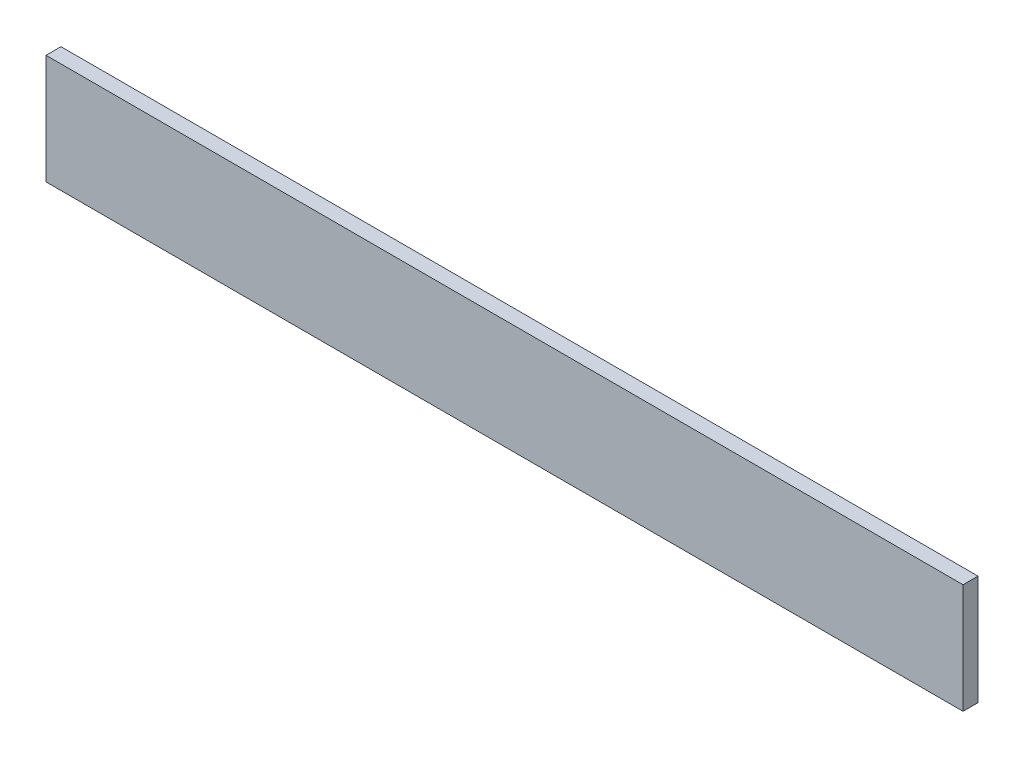
ISO-10303-21;
HEADER;
FILE_DESCRIPTION(('STEP AP214'),'2;1');
FILE_NAME('part.step','',(''),(''),'','','');
FILE_SCHEMA(('AUTOMOTIVE_DESIGN { 1 0 10303 214 1 1 1 1 }'));
ENDSEC;
DATA;
#1=APPLICATION_CONTEXT('core data for automotive mechanical design processes');
#2=APPLICATION_PROTOCOL_DEFINITION('international standard','automotive_design',2000,#1);
#3=PRODUCT_CONTEXT('',#1,'mechanical');
#4=PRODUCT('Part','Part','',(#3));
#5=PRODUCT_RELATED_PRODUCT_CATEGORY('part','',(#4));
#6=PRODUCT_DEFINITION_FORMATION('','',#4);
#7=PRODUCT_DEFINITION_CONTEXT('part definition',#1,'design');
#8=PRODUCT_DEFINITION('design','',#6,#7);
#9=PRODUCT_DEFINITION_SHAPE('','',#8);
#10=(LENGTH_UNIT() NAMED_UNIT(*) SI_UNIT(.MILLI.,.METRE.));
#11=(NAMED_UNIT(*) PLANE_ANGLE_UNIT() SI_UNIT($,.RADIAN.));
#12=(NAMED_UNIT(*) SI_UNIT($,.STERADIAN.) SOLID_ANGLE_UNIT());
#13=UNCERTAINTY_MEASURE_WITH_UNIT(LENGTH_MEASURE(1.E-05),#10,'distance_accuracy_value','');
#14=(GEOMETRIC_REPRESENTATION_CONTEXT(3) GLOBAL_UNCERTAINTY_ASSIGNED_CONTEXT((#13)) GLOBAL_UNIT_ASSIGNED_CONTEXT((#10,
#11,#12)) REPRESENTATION_CONTEXT('',''));
#15=CARTESIAN_POINT('',(0.,0.,0.));
#16=DIRECTION('',(0.,0.,1.));
#17=DIRECTION('',(1.,0.,0.));
#18=AXIS2_PLACEMENT_3D('',#15,#16,#17);
#19=CARTESIAN_POINT('',(0.,0.,19.05));
#20=DIRECTION('',(0.,0.,1.));
#21=DIRECTION('',(1.,0.,0.));
#22=AXIS2_PLACEMENT_3D('',#19,#20,#21);
#23=PLANE('',#22);
#24=DIRECTION('',(0.,1.,0.));
#25=VECTOR('',#24,1.);
#26=CARTESIAN_POINT('',(0.,139.7,19.05));
#27=LINE('',#26,#25);
#28=CARTESIAN_POINT('',(0.,0.,19.05));
#29=VERTEX_POINT('',#28);
#30=CARTESIAN_POINT('',(0.,139.7,19.05));
#31=VERTEX_POINT('',#30);
#32=EDGE_CURVE('E67',#29,#31,#27,.T.);
#33=ORIENTED_EDGE('',*,*,#32,.F.);
#34=DIRECTION('',(1.,0.,0.));
#35=VECTOR('',#34,1.);
#36=CARTESIAN_POINT('',(0.,0.,19.05));
#37=LINE('',#36,#35);
#38=CARTESIAN_POINT('',(1168.4,0.,19.05));
#39=VERTEX_POINT('',#38);
#40=EDGE_CURVE('E19',#39,#29,#37,.F.);
#41=ORIENTED_EDGE('',*,*,#40,.F.);
#42=DIRECTION('',(0.,1.,0.));
#43=VECTOR('',#42,1.);
#44=CARTESIAN_POINT('',(1168.4,0.,19.05));
#45=LINE('',#44,#43);
#46=CARTESIAN_POINT('',(1168.4,139.7,19.05));
#47=VERTEX_POINT('',#46);
#48=EDGE_CURVE('E57',#47,#39,#45,.F.);
#49=ORIENTED_EDGE('',*,*,#48,.F.);
#50=DIRECTION('',(1.,0.,0.));
#51=VECTOR('',#50,1.);
#52=CARTESIAN_POINT('',(1168.4,139.7,19.05));
#53=LINE('',#52,#51);
#54=EDGE_CURVE('E52',#31,#47,#53,.T.);
#55=ORIENTED_EDGE('',*,*,#54,.F.);
#56=EDGE_LOOP('',(#33,#41,#49,#55));
#57=FACE_BOUND('',#56,.T.);
#58=ADVANCED_FACE('F16',(#57),#23,.T.);
#59=CARTESIAN_POINT('',(0.,0.,0.));
#60=DIRECTION('',(0.,-1.,0.));
#61=DIRECTION('',(0.,0.,-1.));
#62=AXIS2_PLACEMENT_3D('',#59,#60,#61);
#63=PLANE('',#62);
#64=DIRECTION('',(0.,0.,1.));
#65=VECTOR('',#64,1.);
#66=CARTESIAN_POINT('',(0.,0.,0.));
#67=LINE('',#66,#65);
#68=CARTESIAN_POINT('',(0.,0.,0.));
#69=VERTEX_POINT('',#68);
#70=EDGE_CURVE('E78',#69,#29,#67,.T.);
#71=ORIENTED_EDGE('',*,*,#70,.F.);
#72=DIRECTION('',(1.,0.,0.));
#73=VECTOR('',#72,1.);
#74=CARTESIAN_POINT('',(0.,0.,0.));
#75=LINE('',#74,#73);
#76=CARTESIAN_POINT('',(1168.4,0.,0.));
#77=VERTEX_POINT('',#76);
#78=EDGE_CURVE('E73',#69,#77,#75,.T.);
#79=ORIENTED_EDGE('',*,*,#78,.T.);
#80=DIRECTION('',(0.,0.,-1.));
#81=VECTOR('',#80,1.);
#82=CARTESIAN_POINT('',(1168.4,0.,0.));
#83=LINE('',#82,#81);
#84=EDGE_CURVE('E62',#39,#77,#83,.T.);
#85=ORIENTED_EDGE('',*,*,#84,.F.);
#86=ORIENTED_EDGE('',*,*,#40,.T.);
#87=EDGE_LOOP('',(#71,#79,#85,#86));
#88=FACE_BOUND('',#87,.T.);
#89=ADVANCED_FACE('F72',(#88),#63,.T.);
#90=CARTESIAN_POINT('',(1168.4,0.,0.));
#91=DIRECTION('',(1.,0.,0.));
#92=DIRECTION('',(0.,0.,-1.));
#93=AXIS2_PLACEMENT_3D('',#90,#91,#92);
#94=PLANE('',#93);
#95=ORIENTED_EDGE('',*,*,#84,.T.);
#96=DIRECTION('',(0.,1.,0.));
#97=VECTOR('',#96,1.);
#98=CARTESIAN_POINT('',(1168.4,0.,0.));
#99=LINE('',#98,#97);
#100=CARTESIAN_POINT('',(1168.4,139.7,0.));
#101=VERTEX_POINT('',#100);
#102=EDGE_CURVE('E83',#77,#101,#99,.T.);
#103=ORIENTED_EDGE('',*,*,#102,.T.);
#104=DIRECTION('',(0.,0.,1.));
#105=VECTOR('',#104,1.);
#106=CARTESIAN_POINT('',(1168.4,139.7,0.));
#107=LINE('',#106,#105);
#108=EDGE_CURVE('E64',#47,#101,#107,.F.);
#109=ORIENTED_EDGE('',*,*,#108,.F.);
#110=ORIENTED_EDGE('',*,*,#48,.T.);
#111=EDGE_LOOP('',(#95,#103,#109,#110));
#112=FACE_BOUND('',#111,.T.);
#113=ADVANCED_FACE('F59',(#112),#94,.T.);
#114=CARTESIAN_POINT('',(1168.4,139.7,0.));
#115=DIRECTION('',(0.,1.,0.));
#116=DIRECTION('',(0.,0.,1.));
#117=AXIS2_PLACEMENT_3D('',#114,#115,#116);
#118=PLANE('',#117);
#119=ORIENTED_EDGE('',*,*,#108,.T.);
#120=DIRECTION('',(1.,0.,0.));
#121=VECTOR('',#120,1.);
#122=CARTESIAN_POINT('',(0.,139.7,0.));
#123=LINE('',#122,#121);
#124=CARTESIAN_POINT('',(0.,139.7,0.));
#125=VERTEX_POINT('',#124);
#126=EDGE_CURVE('E25',#101,#125,#123,.F.);
#127=ORIENTED_EDGE('',*,*,#126,.T.);
#128=DIRECTION('',(0.,0.,1.));
#129=VECTOR('',#128,1.);
#130=CARTESIAN_POINT('',(0.,139.7,0.));
#131=LINE('',#130,#129);
#132=EDGE_CURVE('E33',#31,#125,#131,.F.);
#133=ORIENTED_EDGE('',*,*,#132,.F.);
#134=ORIENTED_EDGE('',*,*,#54,.T.);
#135=EDGE_LOOP('',(#119,#127,#133,#134));
#136=FACE_BOUND('',#135,.T.);
#137=ADVANCED_FACE('F87',(#136),#118,.T.);
#138=CARTESIAN_POINT('',(0.,139.7,0.));
#139=DIRECTION('',(-1.,0.,0.));
#140=DIRECTION('',(0.,0.,1.));
#141=AXIS2_PLACEMENT_3D('',#138,#139,#140);
#142=PLANE('',#141);
#143=ORIENTED_EDGE('',*,*,#132,.T.);
#144=DIRECTION('',(0.,1.,0.));
#145=VECTOR('',#144,1.);
#146=CARTESIAN_POINT('',(0.,0.,0.));
#147=LINE('',#146,#145);
#148=EDGE_CURVE('E11',#125,#69,#147,.F.);
#149=ORIENTED_EDGE('',*,*,#148,.T.);
#150=ORIENTED_EDGE('',*,*,#70,.T.);
#151=ORIENTED_EDGE('',*,*,#32,.T.);
#152=EDGE_LOOP('',(#143,#149,#150,#151));
#153=FACE_BOUND('',#152,.T.);
#154=ADVANCED_FACE('F90',(#153),#142,.T.);
#155=CARTESIAN_POINT('',(0.,0.,0.));
#156=DIRECTION('',(0.,0.,1.));
#157=DIRECTION('',(1.,0.,0.));
#158=AXIS2_PLACEMENT_3D('',#155,#156,#157);
#159=PLANE('',#158);
#160=ORIENTED_EDGE('',*,*,#126,.F.);
#161=ORIENTED_EDGE('',*,*,#102,.F.);
#162=ORIENTED_EDGE('',*,*,#78,.F.);
#163=ORIENTED_EDGE('',*,*,#148,.F.);
#164=EDGE_LOOP('',(#160,#161,#162,#163));
#165=FACE_BOUND('',#164,.T.);
#166=ADVANCED_FACE('F89',(#165),#159,.F.);
#167=CLOSED_SHELL('',(#58,#89,#113,#137,#154,#166));
#168=MANIFOLD_SOLID_BREP('B1',#167);
#169=ADVANCED_BREP_SHAPE_REPRESENTATION('',(#18,#168),#14);
#170=SHAPE_DEFINITION_REPRESENTATION(#9,#169);
ENDSEC;
END-ISO-10303-21;
